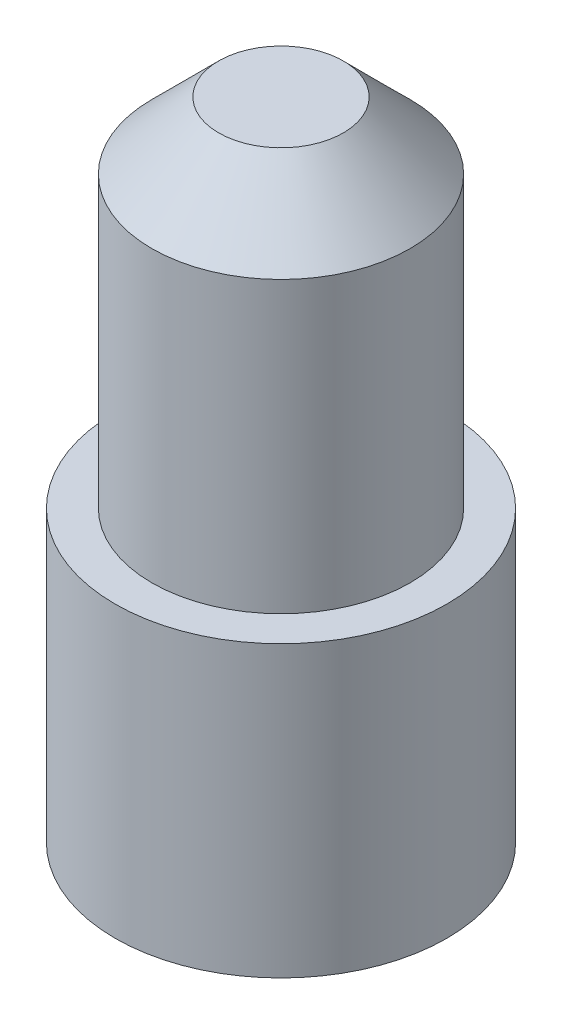
ISO-10303-21;
HEADER;
FILE_DESCRIPTION(('STEP AP214'),'2;1');
FILE_NAME('part.step','',(''),(''),'','','');
FILE_SCHEMA(('AUTOMOTIVE_DESIGN { 1 0 10303 214 1 1 1 1 }'));
ENDSEC;
DATA;
#1=APPLICATION_CONTEXT('core data for automotive mechanical design processes');
#2=APPLICATION_PROTOCOL_DEFINITION('international standard','automotive_design',2000,#1);
#3=PRODUCT_CONTEXT('',#1,'mechanical');
#4=PRODUCT('Part','Part','',(#3));
#5=PRODUCT_RELATED_PRODUCT_CATEGORY('part','',(#4));
#6=PRODUCT_DEFINITION_FORMATION('','',#4);
#7=PRODUCT_DEFINITION_CONTEXT('part definition',#1,'design');
#8=PRODUCT_DEFINITION('design','',#6,#7);
#9=PRODUCT_DEFINITION_SHAPE('','',#8);
#10=(LENGTH_UNIT() NAMED_UNIT(*) SI_UNIT(.MILLI.,.METRE.));
#11=(NAMED_UNIT(*) PLANE_ANGLE_UNIT() SI_UNIT($,.RADIAN.));
#12=(NAMED_UNIT(*) SI_UNIT($,.STERADIAN.) SOLID_ANGLE_UNIT());
#13=UNCERTAINTY_MEASURE_WITH_UNIT(LENGTH_MEASURE(1.E-05),#10,'distance_accuracy_value','');
#14=(GEOMETRIC_REPRESENTATION_CONTEXT(3) GLOBAL_UNCERTAINTY_ASSIGNED_CONTEXT((#13)) GLOBAL_UNIT_ASSIGNED_CONTEXT((#10,
#11,#12)) REPRESENTATION_CONTEXT('',''));
#15=CARTESIAN_POINT('',(0.,0.,0.));
#16=DIRECTION('',(0.,0.,1.));
#17=DIRECTION('',(1.,0.,0.));
#18=AXIS2_PLACEMENT_3D('',#15,#16,#17);
#19=CARTESIAN_POINT('',(0.,-1.12500000000001,0.));
#20=DIRECTION('',(0.,-1.,0.));
#21=DIRECTION('',(0.,0.,-1.));
#22=AXIS2_PLACEMENT_3D('',#19,#20,#21);
#23=PLANE('',#22);
#24=CARTESIAN_POINT('',(0.,-1.12500000000001,0.));
#25=DIRECTION('',(0.,1.,0.));
#26=DIRECTION('',(0.,0.,1.));
#27=AXIS2_PLACEMENT_3D('',#24,#25,#26);
#28=CIRCLE('',#27,1.4);
#29=CARTESIAN_POINT('',(0.,-1.12500000000001,1.4));
#30=VERTEX_POINT('',#29);
#31=EDGE_CURVE('E62',#30,#30,#28,.T.);
#32=ORIENTED_EDGE('',*,*,#31,.T.);
#33=EDGE_LOOP('',(#32));
#34=FACE_BOUND('',#33,.T.);
#35=ADVANCED_FACE('F39',(#34),#23,.F.);
#36=CARTESIAN_POINT('',(0.,-15.625,0.));
#37=DIRECTION('',(0.,1.,0.));
#38=DIRECTION('',(0.,0.,1.));
#39=AXIS2_PLACEMENT_3D('',#36,#37,#38);
#40=PLANE('',#39);
#41=CARTESIAN_POINT('',(0.,-15.625,0.));
#42=DIRECTION('',(0.,1.,0.));
#43=DIRECTION('',(0.,0.,1.));
#44=AXIS2_PLACEMENT_3D('',#41,#42,#43);
#45=CIRCLE('',#44,3.725);
#46=CARTESIAN_POINT('',(0.,-15.625,3.725));
#47=VERTEX_POINT('',#46);
#48=EDGE_CURVE('E10',#47,#47,#45,.T.);
#49=ORIENTED_EDGE('',*,*,#48,.F.);
#50=EDGE_LOOP('',(#49));
#51=FACE_BOUND('',#50,.T.);
#52=ADVANCED_FACE('F87',(#51),#40,.F.);
#53=CARTESIAN_POINT('',(0.,19.9583333333334,0.));
#54=DIRECTION('',(0.,1.,0.));
#55=DIRECTION('',(0.,0.,1.));
#56=AXIS2_PLACEMENT_3D('',#53,#54,#55);
#57=CYLINDRICAL_SURFACE('',#56,3.725);
#58=CARTESIAN_POINT('',(0.,-9.12500000000001,0.));
#59=DIRECTION('',(0.,1.,0.));
#60=DIRECTION('',(0.,0.,1.));
#61=AXIS2_PLACEMENT_3D('',#58,#59,#60);
#62=CIRCLE('',#61,3.725);
#63=CARTESIAN_POINT('',(0.,-9.12500000000001,3.725));
#64=VERTEX_POINT('',#63);
#65=EDGE_CURVE('E46',#64,#64,#62,.T.);
#66=ORIENTED_EDGE('',*,*,#65,.F.);
#67=EDGE_LOOP('',(#66));
#68=FACE_BOUND('',#67,.T.);
#69=ORIENTED_EDGE('',*,*,#48,.T.);
#70=EDGE_LOOP('',(#69));
#71=FACE_BOUND('',#70,.T.);
#72=ADVANCED_FACE('F82',(#68,#71),#57,.T.);
#73=CARTESIAN_POINT('',(0.,-9.12500000000001,0.));
#74=DIRECTION('',(0.,-1.,0.));
#75=DIRECTION('',(0.,0.,-1.));
#76=AXIS2_PLACEMENT_3D('',#73,#74,#75);
#77=PLANE('',#76);
#78=CARTESIAN_POINT('',(0.,-9.12500000000001,0.));
#79=DIRECTION('',(0.,1.,0.));
#80=DIRECTION('',(0.,0.,1.));
#81=AXIS2_PLACEMENT_3D('',#78,#79,#80);
#82=CIRCLE('',#81,2.9);
#83=CARTESIAN_POINT('',(0.,-9.12500000000001,2.9));
#84=VERTEX_POINT('',#83);
#85=EDGE_CURVE('E51',#84,#84,#82,.T.);
#86=ORIENTED_EDGE('',*,*,#85,.F.);
#87=EDGE_LOOP('',(#86));
#88=FACE_BOUND('',#87,.T.);
#89=ORIENTED_EDGE('',*,*,#65,.T.);
#90=EDGE_LOOP('',(#89));
#91=FACE_BOUND('',#90,.T.);
#92=ADVANCED_FACE('F77',(#88,#91),#77,.F.);
#93=CARTESIAN_POINT('',(0.,19.9583333333334,0.));
#94=DIRECTION('',(0.,1.,0.));
#95=DIRECTION('',(0.,0.,1.));
#96=AXIS2_PLACEMENT_3D('',#93,#94,#95);
#97=CYLINDRICAL_SURFACE('',#96,2.9);
#98=CARTESIAN_POINT('',(0.,-2.62500000000001,0.));
#99=DIRECTION('',(0.,1.,0.));
#100=DIRECTION('',(0.,0.,1.));
#101=AXIS2_PLACEMENT_3D('',#98,#99,#100);
#102=CIRCLE('',#101,2.9);
#103=CARTESIAN_POINT('',(0.,-2.62500000000001,2.9));
#104=VERTEX_POINT('',#103);
#105=EDGE_CURVE('E56',#104,#104,#102,.T.);
#106=ORIENTED_EDGE('',*,*,#105,.F.);
#107=EDGE_LOOP('',(#106));
#108=FACE_BOUND('',#107,.T.);
#109=ORIENTED_EDGE('',*,*,#85,.T.);
#110=EDGE_LOOP('',(#109));
#111=FACE_BOUND('',#110,.T.);
#112=ADVANCED_FACE('F71',(#108,#111),#97,.T.);
#113=CARTESIAN_POINT('',(0.,-2.62500000000001,0.));
#114=DIRECTION('',(0.,-1.,0.));
#115=DIRECTION('',(0.,0.,-1.));
#116=AXIS2_PLACEMENT_3D('',#113,#114,#115);
#117=CONICAL_SURFACE('',#116,2.9,0.785398163397448);
#118=ORIENTED_EDGE('',*,*,#31,.F.);
#119=EDGE_LOOP('',(#118));
#120=FACE_BOUND('',#119,.T.);
#121=ORIENTED_EDGE('',*,*,#105,.T.);
#122=EDGE_LOOP('',(#121));
#123=FACE_BOUND('',#122,.T.);
#124=ADVANCED_FACE('F68',(#120,#123),#117,.T.);
#125=CLOSED_SHELL('',(#35,#52,#72,#92,#112,#124));
#126=MANIFOLD_SOLID_BREP('B2',#125);
#127=ADVANCED_BREP_SHAPE_REPRESENTATION('',(#18,#126),#14);
#128=SHAPE_DEFINITION_REPRESENTATION(#9,#127);
ENDSEC;
END-ISO-10303-21;
